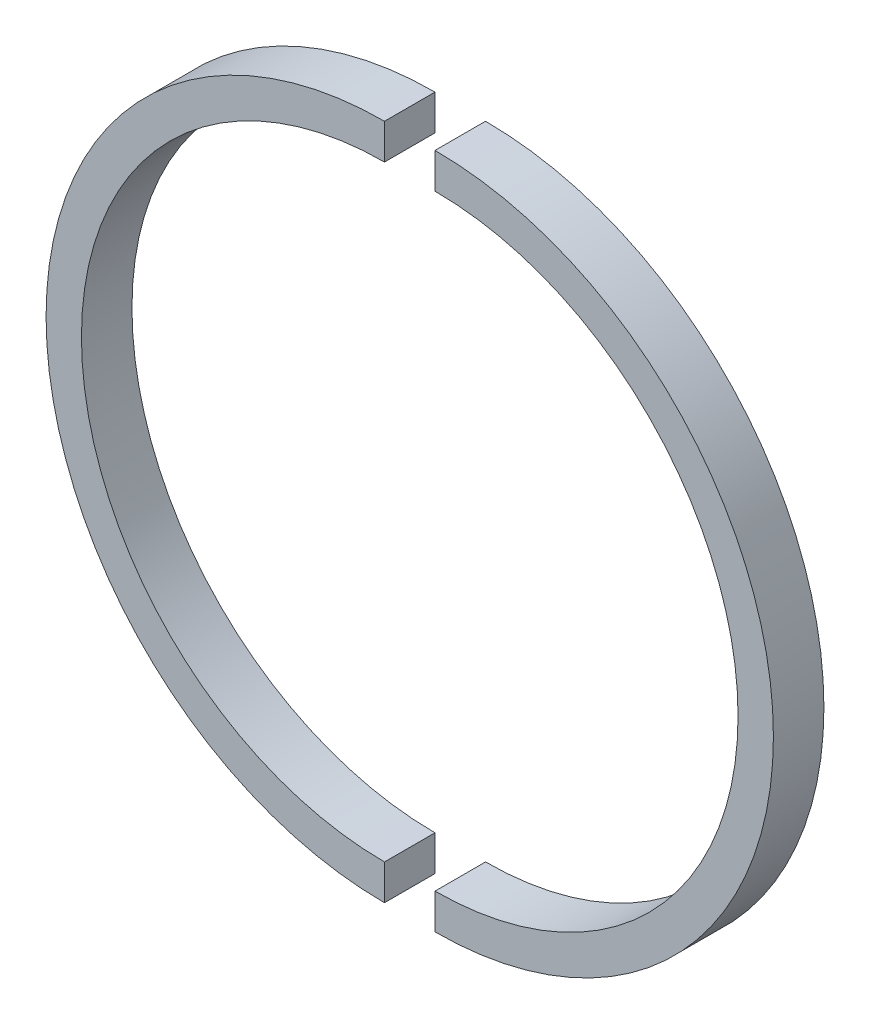
ISO-10303-21;
HEADER;
FILE_DESCRIPTION(('STEP AP214'),'2;1');
FILE_NAME('part.step','',(''),(''),'','','');
FILE_SCHEMA(('AUTOMOTIVE_DESIGN { 1 0 10303 214 1 1 1 1 }'));
ENDSEC;
DATA;
#1=APPLICATION_CONTEXT('core data for automotive mechanical design processes');
#2=APPLICATION_PROTOCOL_DEFINITION('international standard','automotive_design',2000,#1);
#3=PRODUCT_CONTEXT('',#1,'mechanical');
#4=PRODUCT('Part','Part','',(#3));
#5=PRODUCT_RELATED_PRODUCT_CATEGORY('part','',(#4));
#6=PRODUCT_DEFINITION_FORMATION('','',#4);
#7=PRODUCT_DEFINITION_CONTEXT('part definition',#1,'design');
#8=PRODUCT_DEFINITION('design','',#6,#7);
#9=PRODUCT_DEFINITION_SHAPE('','',#8);
#10=(LENGTH_UNIT() NAMED_UNIT(*) SI_UNIT(.MILLI.,.METRE.));
#11=(NAMED_UNIT(*) PLANE_ANGLE_UNIT() SI_UNIT($,.RADIAN.));
#12=(NAMED_UNIT(*) SI_UNIT($,.STERADIAN.) SOLID_ANGLE_UNIT());
#13=UNCERTAINTY_MEASURE_WITH_UNIT(LENGTH_MEASURE(1.E-05),#10,'distance_accuracy_value','');
#14=(GEOMETRIC_REPRESENTATION_CONTEXT(3) GLOBAL_UNCERTAINTY_ASSIGNED_CONTEXT((#13)) GLOBAL_UNIT_ASSIGNED_CONTEXT((#10,
#11,#12)) REPRESENTATION_CONTEXT('',''));
#15=CARTESIAN_POINT('',(0.,0.,0.));
#16=DIRECTION('',(0.,0.,1.));
#17=DIRECTION('',(1.,0.,0.));
#18=AXIS2_PLACEMENT_3D('',#15,#16,#17);
#19=CARTESIAN_POINT('',(10.,-59.9999999999999,-4.99999999999999));
#20=DIRECTION('',(0.,0.,1.));
#21=DIRECTION('',(1.,0.,0.));
#22=AXIS2_PLACEMENT_3D('',#19,#20,#21);
#23=PLANE('',#22);
#24=CARTESIAN_POINT('',(10.,0.,-4.99999999999999));
#25=DIRECTION('',(0.,0.,1.));
#26=DIRECTION('',(1.,0.,0.));
#27=AXIS2_PLACEMENT_3D('',#24,#25,#26);
#28=CIRCLE('',#27,60.);
#29=CARTESIAN_POINT('',(10.,-59.9999999999999,-4.99999999999999));
#30=VERTEX_POINT('',#29);
#31=CARTESIAN_POINT('',(9.99999999999958,60.0000000000001,-4.99999999999999));
#32=VERTEX_POINT('',#31);
#33=EDGE_CURVE('E12',#30,#32,#28,.T.);
#34=ORIENTED_EDGE('',*,*,#33,.T.);
#35=DIRECTION('',(0.,1.,0.));
#36=VECTOR('',#35,1.);
#37=CARTESIAN_POINT('',(9.99999999999958,60.0000000000001,-4.99999999999999));
#38=LINE('',#37,#36);
#39=CARTESIAN_POINT('',(9.99999999999953,67.0000000000001,-4.99999999999999));
#40=VERTEX_POINT('',#39);
#41=EDGE_CURVE('E101',#32,#40,#38,.T.);
#42=ORIENTED_EDGE('',*,*,#41,.T.);
#43=CARTESIAN_POINT('',(10.,0.,-4.99999999999999));
#44=DIRECTION('',(0.,0.,1.));
#45=DIRECTION('',(1.,0.,0.));
#46=AXIS2_PLACEMENT_3D('',#43,#44,#45);
#47=CIRCLE('',#46,67.);
#48=CARTESIAN_POINT('',(10.,-66.9999999999999,-4.99999999999999));
#49=VERTEX_POINT('',#48);
#50=EDGE_CURVE('E83',#49,#40,#47,.T.);
#51=ORIENTED_EDGE('',*,*,#50,.F.);
#52=DIRECTION('',(0.,-1.,0.));
#53=VECTOR('',#52,1.);
#54=CARTESIAN_POINT('',(10.,-59.9999999999999,-4.99999999999999));
#55=LINE('',#54,#53);
#56=EDGE_CURVE('E109',#30,#49,#55,.T.);
#57=ORIENTED_EDGE('',*,*,#56,.F.);
#58=EDGE_LOOP('',(#34,#42,#51,#57));
#59=FACE_BOUND('',#58,.T.);
#60=ADVANCED_FACE('F43',(#59),#23,.F.);
#61=CARTESIAN_POINT('',(10.,0.,23.3476552485724));
#62=DIRECTION('',(0.,0.,1.));
#63=DIRECTION('',(1.,0.,0.));
#64=AXIS2_PLACEMENT_3D('',#61,#62,#63);
#65=CYLINDRICAL_SURFACE('',#64,60.);
#66=CARTESIAN_POINT('',(10.,0.,5.00000000000001));
#67=DIRECTION('',(0.,0.,1.));
#68=DIRECTION('',(1.,0.,0.));
#69=AXIS2_PLACEMENT_3D('',#66,#67,#68);
#70=CIRCLE('',#69,60.);
#71=CARTESIAN_POINT('',(10.,-59.9999999999999,5.00000000000001));
#72=VERTEX_POINT('',#71);
#73=CARTESIAN_POINT('',(9.99999999999958,60.0000000000001,5.00000000000001));
#74=VERTEX_POINT('',#73);
#75=EDGE_CURVE('E51',#72,#74,#70,.T.);
#76=ORIENTED_EDGE('',*,*,#75,.T.);
#77=DIRECTION('',(0.,0.,-1.));
#78=VECTOR('',#77,1.);
#79=CARTESIAN_POINT('',(9.99999999999958,60.0000000000001,5.00000000000001));
#80=LINE('',#79,#78);
#81=EDGE_CURVE('E107',#74,#32,#80,.T.);
#82=ORIENTED_EDGE('',*,*,#81,.T.);
#83=ORIENTED_EDGE('',*,*,#33,.F.);
#84=DIRECTION('',(0.,0.,-1.));
#85=VECTOR('',#84,1.);
#86=CARTESIAN_POINT('',(10.,-59.9999999999999,5.00000000000001));
#87=LINE('',#86,#85);
#88=EDGE_CURVE('E95',#72,#30,#87,.T.);
#89=ORIENTED_EDGE('',*,*,#88,.F.);
#90=EDGE_LOOP('',(#76,#82,#83,#89));
#91=FACE_BOUND('',#90,.T.);
#92=ADVANCED_FACE('F45',(#91),#65,.F.);
#93=CARTESIAN_POINT('',(10.,-66.9999999999999,5.00000000000001));
#94=DIRECTION('',(0.,0.,-1.));
#95=DIRECTION('',(-1.,0.,0.));
#96=AXIS2_PLACEMENT_3D('',#93,#94,#95);
#97=PLANE('',#96);
#98=CARTESIAN_POINT('',(10.,0.,5.00000000000001));
#99=DIRECTION('',(0.,0.,1.));
#100=DIRECTION('',(1.,0.,0.));
#101=AXIS2_PLACEMENT_3D('',#98,#99,#100);
#102=CIRCLE('',#101,67.);
#103=CARTESIAN_POINT('',(10.,-66.9999999999999,5.00000000000001));
#104=VERTEX_POINT('',#103);
#105=CARTESIAN_POINT('',(9.99999999999953,67.0000000000001,5.00000000000001));
#106=VERTEX_POINT('',#105);
#107=EDGE_CURVE('E94',#104,#106,#102,.T.);
#108=ORIENTED_EDGE('',*,*,#107,.T.);
#109=DIRECTION('',(0.,-1.,0.));
#110=VECTOR('',#109,1.);
#111=CARTESIAN_POINT('',(9.99999999999953,67.0000000000001,5.00000000000001));
#112=LINE('',#111,#110);
#113=EDGE_CURVE('E102',#106,#74,#112,.T.);
#114=ORIENTED_EDGE('',*,*,#113,.T.);
#115=ORIENTED_EDGE('',*,*,#75,.F.);
#116=DIRECTION('',(0.,1.,0.));
#117=VECTOR('',#116,1.);
#118=CARTESIAN_POINT('',(10.,-66.9999999999999,5.00000000000001));
#119=LINE('',#118,#117);
#120=EDGE_CURVE('E112',#104,#72,#119,.T.);
#121=ORIENTED_EDGE('',*,*,#120,.F.);
#122=EDGE_LOOP('',(#108,#114,#115,#121));
#123=FACE_BOUND('',#122,.T.);
#124=ADVANCED_FACE('F115',(#123),#97,.F.);
#125=CARTESIAN_POINT('',(10.,0.,23.3476552485724));
#126=DIRECTION('',(0.,0.,1.));
#127=DIRECTION('',(1.,0.,0.));
#128=AXIS2_PLACEMENT_3D('',#125,#126,#127);
#129=CYLINDRICAL_SURFACE('',#128,67.);
#130=DIRECTION('',(0.,0.,1.));
#131=VECTOR('',#130,1.);
#132=CARTESIAN_POINT('',(10.,-66.9999999999999,-4.99999999999999));
#133=LINE('',#132,#131);
#134=EDGE_CURVE('E89',#49,#104,#133,.T.);
#135=ORIENTED_EDGE('',*,*,#134,.F.);
#136=ORIENTED_EDGE('',*,*,#50,.T.);
#137=DIRECTION('',(0.,0.,1.));
#138=VECTOR('',#137,1.);
#139=CARTESIAN_POINT('',(9.99999999999953,67.0000000000001,-4.99999999999999));
#140=LINE('',#139,#138);
#141=EDGE_CURVE('E86',#40,#106,#140,.T.);
#142=ORIENTED_EDGE('',*,*,#141,.T.);
#143=ORIENTED_EDGE('',*,*,#107,.F.);
#144=EDGE_LOOP('',(#135,#136,#142,#143));
#145=FACE_BOUND('',#144,.T.);
#146=ADVANCED_FACE('F85',(#145),#129,.T.);
#147=CARTESIAN_POINT('',(10.,-66.9999999999999,-4.99999999999999));
#148=DIRECTION('',(-1.,0.,0.));
#149=DIRECTION('',(0.,-1.,0.));
#150=AXIS2_PLACEMENT_3D('',#147,#148,#149);
#151=PLANE('',#150);
#152=ORIENTED_EDGE('',*,*,#56,.T.);
#153=ORIENTED_EDGE('',*,*,#134,.T.);
#154=ORIENTED_EDGE('',*,*,#120,.T.);
#155=ORIENTED_EDGE('',*,*,#88,.T.);
#156=EDGE_LOOP('',(#152,#153,#154,#155));
#157=FACE_BOUND('',#156,.T.);
#158=ADVANCED_FACE('F117',(#157),#151,.T.);
#159=CARTESIAN_POINT('',(9.99999999999953,67.0000000000001,-4.99999999999999));
#160=DIRECTION('',(1.,0.,0.));
#161=DIRECTION('',(0.,1.,0.));
#162=AXIS2_PLACEMENT_3D('',#159,#160,#161);
#163=PLANE('',#162);
#164=ORIENTED_EDGE('',*,*,#41,.F.);
#165=ORIENTED_EDGE('',*,*,#81,.F.);
#166=ORIENTED_EDGE('',*,*,#113,.F.);
#167=ORIENTED_EDGE('',*,*,#141,.F.);
#168=EDGE_LOOP('',(#164,#165,#166,#167));
#169=FACE_BOUND('',#168,.T.);
#170=ADVANCED_FACE('F99',(#169),#163,.F.);
#171=CLOSED_SHELL('',(#60,#92,#124,#146,#158,#170));
#172=MANIFOLD_SOLID_BREP('B2',#171);
#173=CARTESIAN_POINT('',(4.6785849940498E-13,-67.,5.00000000000001));
#174=DIRECTION('',(0.,0.,1.));
#175=DIRECTION('',(1.,0.,0.));
#176=AXIS2_PLACEMENT_3D('',#173,#174,#175);
#177=PLANE('',#176);
#178=CARTESIAN_POINT('',(0.,0.,5.00000000000001));
#179=DIRECTION('',(0.,0.,-1.));
#180=DIRECTION('',(-1.,0.,0.));
#181=AXIS2_PLACEMENT_3D('',#178,#179,#180);
#182=CIRCLE('',#181,60.);
#183=CARTESIAN_POINT('',(4.18977760661176E-13,-60.,5.00000000000001));
#184=VERTEX_POINT('',#183);
#185=CARTESIAN_POINT('',(0.,60.,5.00000000000001));
#186=VERTEX_POINT('',#185);
#187=EDGE_CURVE('E41',#184,#186,#182,.T.);
#188=ORIENTED_EDGE('',*,*,#187,.T.);
#189=DIRECTION('',(0.,-1.,0.));
#190=VECTOR('',#189,1.);
#191=CARTESIAN_POINT('',(0.,67.,5.00000000000001));
#192=LINE('',#191,#190);
#193=CARTESIAN_POINT('',(0.,67.,5.00000000000001));
#194=VERTEX_POINT('',#193);
#195=EDGE_CURVE('E207',#194,#186,#192,.T.);
#196=ORIENTED_EDGE('',*,*,#195,.F.);
#197=CARTESIAN_POINT('',(0.,0.,5.00000000000001));
#198=DIRECTION('',(0.,0.,-1.));
#199=DIRECTION('',(-1.,0.,0.));
#200=AXIS2_PLACEMENT_3D('',#197,#198,#199);
#201=CIRCLE('',#200,67.);
#202=CARTESIAN_POINT('',(4.6785849940498E-13,-67.,5.00000000000001));
#203=VERTEX_POINT('',#202);
#204=EDGE_CURVE('E182',#203,#194,#201,.T.);
#205=ORIENTED_EDGE('',*,*,#204,.F.);
#206=DIRECTION('',(0.,1.,0.));
#207=VECTOR('',#206,1.);
#208=CARTESIAN_POINT('',(4.6785849940498E-13,-67.,5.00000000000001));
#209=LINE('',#208,#207);
#210=EDGE_CURVE('E209',#203,#184,#209,.T.);
#211=ORIENTED_EDGE('',*,*,#210,.T.);
#212=EDGE_LOOP('',(#188,#196,#205,#211));
#213=FACE_BOUND('',#212,.T.);
#214=ADVANCED_FACE('F167',(#213),#177,.T.);
#215=CARTESIAN_POINT('',(0.,0.,29.8743832473673));
#216=DIRECTION('',(0.,0.,-1.));
#217=DIRECTION('',(-1.,0.,0.));
#218=AXIS2_PLACEMENT_3D('',#215,#216,#217);
#219=CYLINDRICAL_SURFACE('',#218,60.);
#220=CARTESIAN_POINT('',(0.,0.,-4.99999999999999));
#221=DIRECTION('',(0.,0.,-1.));
#222=DIRECTION('',(-1.,0.,0.));
#223=AXIS2_PLACEMENT_3D('',#220,#221,#222);
#224=CIRCLE('',#223,60.);
#225=CARTESIAN_POINT('',(4.18977760661176E-13,-60.,-4.99999999999999));
#226=VERTEX_POINT('',#225);
#227=CARTESIAN_POINT('',(0.,60.,-4.99999999999999));
#228=VERTEX_POINT('',#227);
#229=EDGE_CURVE('E175',#226,#228,#224,.T.);
#230=ORIENTED_EDGE('',*,*,#229,.T.);
#231=DIRECTION('',(0.,0.,-1.));
#232=VECTOR('',#231,1.);
#233=CARTESIAN_POINT('',(0.,60.,5.00000000000001));
#234=LINE('',#233,#232);
#235=EDGE_CURVE('E218',#186,#228,#234,.T.);
#236=ORIENTED_EDGE('',*,*,#235,.F.);
#237=ORIENTED_EDGE('',*,*,#187,.F.);
#238=DIRECTION('',(0.,0.,-1.));
#239=VECTOR('',#238,1.);
#240=CARTESIAN_POINT('',(4.18977760661176E-13,-60.,5.00000000000001));
#241=LINE('',#240,#239);
#242=EDGE_CURVE('E228',#184,#226,#241,.T.);
#243=ORIENTED_EDGE('',*,*,#242,.T.);
#244=EDGE_LOOP('',(#230,#236,#237,#243));
#245=FACE_BOUND('',#244,.T.);
#246=ADVANCED_FACE('F169',(#245),#219,.F.);
#247=CARTESIAN_POINT('',(4.6785849940498E-13,-67.,-4.99999999999999));
#248=DIRECTION('',(0.,0.,-1.));
#249=DIRECTION('',(-1.,0.,0.));
#250=AXIS2_PLACEMENT_3D('',#247,#248,#249);
#251=PLANE('',#250);
#252=CARTESIAN_POINT('',(0.,0.,-4.99999999999999));
#253=DIRECTION('',(0.,0.,-1.));
#254=DIRECTION('',(-1.,0.,0.));
#255=AXIS2_PLACEMENT_3D('',#252,#253,#254);
#256=CIRCLE('',#255,67.);
#257=CARTESIAN_POINT('',(4.6785849940498E-13,-67.,-4.99999999999999));
#258=VERTEX_POINT('',#257);
#259=CARTESIAN_POINT('',(0.,67.,-4.99999999999999));
#260=VERTEX_POINT('',#259);
#261=EDGE_CURVE('E190',#258,#260,#256,.T.);
#262=ORIENTED_EDGE('',*,*,#261,.T.);
#263=DIRECTION('',(0.,1.,0.));
#264=VECTOR('',#263,1.);
#265=CARTESIAN_POINT('',(0.,67.,-4.99999999999999));
#266=LINE('',#265,#264);
#267=EDGE_CURVE('E222',#228,#260,#266,.T.);
#268=ORIENTED_EDGE('',*,*,#267,.F.);
#269=ORIENTED_EDGE('',*,*,#229,.F.);
#270=DIRECTION('',(0.,-1.,0.));
#271=VECTOR('',#270,1.);
#272=CARTESIAN_POINT('',(4.6785849940498E-13,-67.,-4.99999999999999));
#273=LINE('',#272,#271);
#274=EDGE_CURVE('E230',#226,#258,#273,.T.);
#275=ORIENTED_EDGE('',*,*,#274,.T.);
#276=EDGE_LOOP('',(#262,#268,#269,#275));
#277=FACE_BOUND('',#276,.T.);
#278=ADVANCED_FACE('F236',(#277),#251,.T.);
#279=CARTESIAN_POINT('',(0.,0.,29.8743832473673));
#280=DIRECTION('',(0.,0.,-1.));
#281=DIRECTION('',(-1.,0.,0.));
#282=AXIS2_PLACEMENT_3D('',#279,#280,#281);
#283=CYLINDRICAL_SURFACE('',#282,67.);
#284=DIRECTION('',(0.,0.,1.));
#285=VECTOR('',#284,1.);
#286=CARTESIAN_POINT('',(4.6785849940498E-13,-67.,5.00000000000001));
#287=LINE('',#286,#285);
#288=EDGE_CURVE('E232',#258,#203,#287,.T.);
#289=ORIENTED_EDGE('',*,*,#288,.T.);
#290=ORIENTED_EDGE('',*,*,#204,.T.);
#291=DIRECTION('',(0.,0.,1.));
#292=VECTOR('',#291,1.);
#293=CARTESIAN_POINT('',(0.,67.,5.00000000000001));
#294=LINE('',#293,#292);
#295=EDGE_CURVE('E220',#260,#194,#294,.T.);
#296=ORIENTED_EDGE('',*,*,#295,.F.);
#297=ORIENTED_EDGE('',*,*,#261,.F.);
#298=EDGE_LOOP('',(#289,#290,#296,#297));
#299=FACE_BOUND('',#298,.T.);
#300=ADVANCED_FACE('F239',(#299),#283,.T.);
#301=CARTESIAN_POINT('',(4.18977760661176E-13,-60.,5.00000000000001));
#302=DIRECTION('',(-1.,0.,0.));
#303=DIRECTION('',(0.,0.,-1.));
#304=AXIS2_PLACEMENT_3D('',#301,#302,#303);
#305=PLANE('',#304);
#306=ORIENTED_EDGE('',*,*,#210,.F.);
#307=ORIENTED_EDGE('',*,*,#288,.F.);
#308=ORIENTED_EDGE('',*,*,#274,.F.);
#309=ORIENTED_EDGE('',*,*,#242,.F.);
#310=EDGE_LOOP('',(#306,#307,#308,#309));
#311=FACE_BOUND('',#310,.T.);
#312=ADVANCED_FACE('F241',(#311),#305,.F.);
#313=CARTESIAN_POINT('',(0.,60.,5.00000000000001));
#314=DIRECTION('',(1.,0.,0.));
#315=DIRECTION('',(0.,0.,-1.));
#316=AXIS2_PLACEMENT_3D('',#313,#314,#315);
#317=PLANE('',#316);
#318=ORIENTED_EDGE('',*,*,#195,.T.);
#319=ORIENTED_EDGE('',*,*,#235,.T.);
#320=ORIENTED_EDGE('',*,*,#267,.T.);
#321=ORIENTED_EDGE('',*,*,#295,.T.);
#322=EDGE_LOOP('',(#318,#319,#320,#321));
#323=FACE_BOUND('',#322,.T.);
#324=ADVANCED_FACE('F216',(#323),#317,.T.);
#325=CLOSED_SHELL('',(#214,#246,#278,#300,#312,#324));
#326=MANIFOLD_SOLID_BREP('B6',#325);
#327=ADVANCED_BREP_SHAPE_REPRESENTATION('',(#18,#172,#326),#14);
#328=SHAPE_DEFINITION_REPRESENTATION(#9,#327);
ENDSEC;
END-ISO-10303-21;
